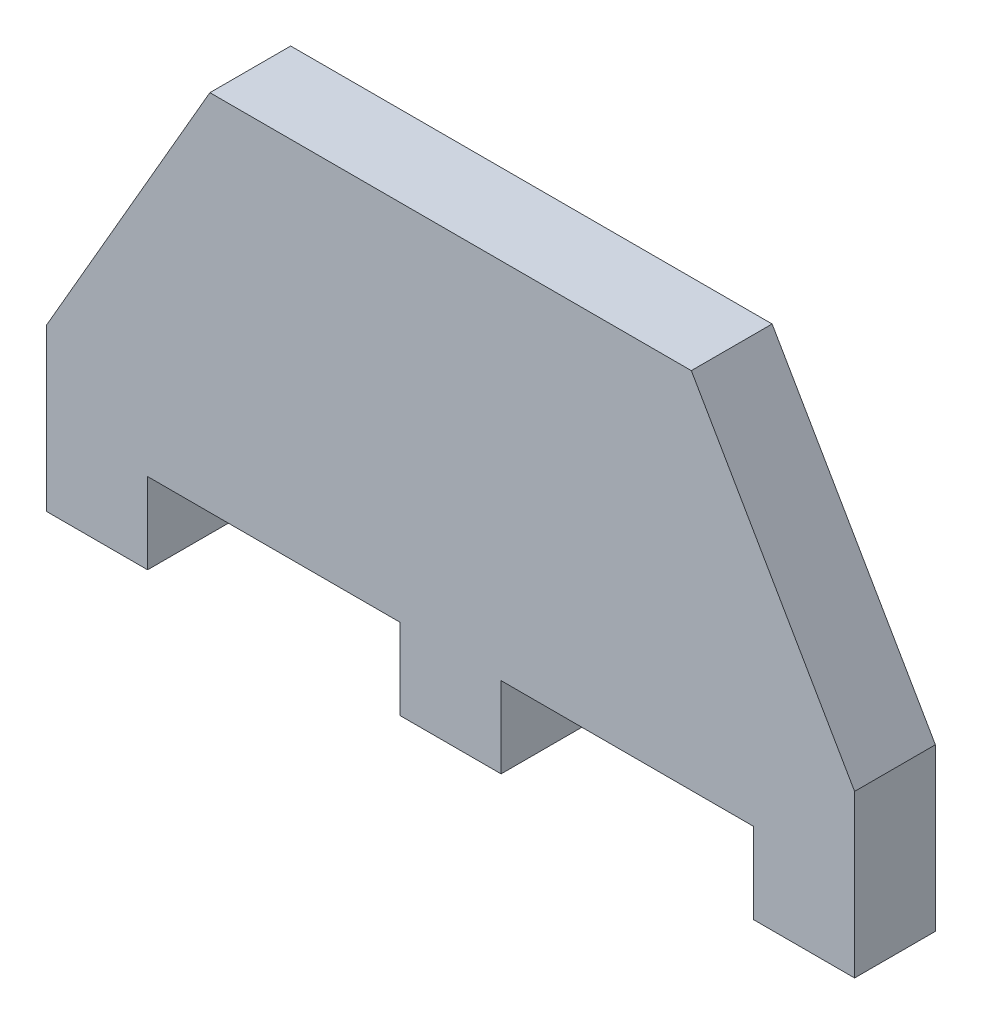
ISO-10303-21;
HEADER;
FILE_DESCRIPTION(('STEP AP214'),'2;1');
FILE_NAME('part.step','',(''),(''),'','','');
FILE_SCHEMA(('AUTOMOTIVE_DESIGN { 1 0 10303 214 1 1 1 1 }'));
ENDSEC;
DATA;
#1=APPLICATION_CONTEXT('core data for automotive mechanical design processes');
#2=APPLICATION_PROTOCOL_DEFINITION('international standard','automotive_design',2000,#1);
#3=PRODUCT_CONTEXT('',#1,'mechanical');
#4=PRODUCT('Part','Part','',(#3));
#5=PRODUCT_RELATED_PRODUCT_CATEGORY('part','',(#4));
#6=PRODUCT_DEFINITION_FORMATION('','',#4);
#7=PRODUCT_DEFINITION_CONTEXT('part definition',#1,'design');
#8=PRODUCT_DEFINITION('design','',#6,#7);
#9=PRODUCT_DEFINITION_SHAPE('','',#8);
#10=(LENGTH_UNIT() NAMED_UNIT(*) SI_UNIT(.MILLI.,.METRE.));
#11=(NAMED_UNIT(*) PLANE_ANGLE_UNIT() SI_UNIT($,.RADIAN.));
#12=(NAMED_UNIT(*) SI_UNIT($,.STERADIAN.) SOLID_ANGLE_UNIT());
#13=UNCERTAINTY_MEASURE_WITH_UNIT(LENGTH_MEASURE(1.E-05),#10,'distance_accuracy_value','');
#14=(GEOMETRIC_REPRESENTATION_CONTEXT(3) GLOBAL_UNCERTAINTY_ASSIGNED_CONTEXT((#13)) GLOBAL_UNIT_ASSIGNED_CONTEXT((#10,
#11,#12)) REPRESENTATION_CONTEXT('',''));
#15=CARTESIAN_POINT('',(0.,0.,0.));
#16=DIRECTION('',(0.,0.,1.));
#17=DIRECTION('',(1.,0.,0.));
#18=AXIS2_PLACEMENT_3D('',#15,#16,#17);
#19=CARTESIAN_POINT('',(0.,0.,10.));
#20=DIRECTION('',(1.,0.,0.));
#21=DIRECTION('',(0.,1.,0.));
#22=AXIS2_PLACEMENT_3D('',#19,#20,#21);
#23=PLANE('',#22);
#24=DIRECTION('',(0.,-1.,0.));
#25=VECTOR('',#24,1.);
#26=CARTESIAN_POINT('',(0.,0.,0.));
#27=LINE('',#26,#25);
#28=CARTESIAN_POINT('',(0.,10.,0.));
#29=VERTEX_POINT('',#28);
#30=CARTESIAN_POINT('',(0.,-10.,0.));
#31=VERTEX_POINT('',#30);
#32=EDGE_CURVE('E102',#29,#31,#27,.T.);
#33=ORIENTED_EDGE('',*,*,#32,.T.);
#34=DIRECTION('',(0.,0.,-1.));
#35=VECTOR('',#34,1.);
#36=CARTESIAN_POINT('',(0.,-10.,10.));
#37=LINE('',#36,#35);
#38=CARTESIAN_POINT('',(0.,-10.,10.));
#39=VERTEX_POINT('',#38);
#40=EDGE_CURVE('E11',#39,#31,#37,.T.);
#41=ORIENTED_EDGE('',*,*,#40,.F.);
#42=DIRECTION('',(0.,-1.,0.));
#43=VECTOR('',#42,1.);
#44=CARTESIAN_POINT('',(0.,10.,10.));
#45=LINE('',#44,#43);
#46=CARTESIAN_POINT('',(0.,10.,10.));
#47=VERTEX_POINT('',#46);
#48=EDGE_CURVE('E108',#47,#39,#45,.T.);
#49=ORIENTED_EDGE('',*,*,#48,.F.);
#50=DIRECTION('',(0.,0.,-1.));
#51=VECTOR('',#50,1.);
#52=CARTESIAN_POINT('',(0.,10.,10.));
#53=LINE('',#52,#51);
#54=EDGE_CURVE('E160',#47,#29,#53,.T.);
#55=ORIENTED_EDGE('',*,*,#54,.T.);
#56=EDGE_LOOP('',(#33,#41,#49,#55));
#57=FACE_BOUND('',#56,.T.);
#58=ADVANCED_FACE('F32',(#57),#23,.F.);
#59=CARTESIAN_POINT('',(0.,-10.,10.));
#60=DIRECTION('',(0.,1.,0.));
#61=DIRECTION('',(0.,0.,1.));
#62=AXIS2_PLACEMENT_3D('',#59,#60,#61);
#63=PLANE('',#62);
#64=DIRECTION('',(1.,0.,0.));
#65=VECTOR('',#64,1.);
#66=CARTESIAN_POINT('',(0.,-10.,0.));
#67=LINE('',#66,#65);
#68=CARTESIAN_POINT('',(12.5,-10.,0.));
#69=VERTEX_POINT('',#68);
#70=EDGE_CURVE('E165',#31,#69,#67,.T.);
#71=ORIENTED_EDGE('',*,*,#70,.T.);
#72=DIRECTION('',(0.,0.,-1.));
#73=VECTOR('',#72,1.);
#74=CARTESIAN_POINT('',(12.5,-10.,10.));
#75=LINE('',#74,#73);
#76=CARTESIAN_POINT('',(12.5,-10.,10.));
#77=VERTEX_POINT('',#76);
#78=EDGE_CURVE('E40',#77,#69,#75,.T.);
#79=ORIENTED_EDGE('',*,*,#78,.F.);
#80=DIRECTION('',(1.,0.,0.));
#81=VECTOR('',#80,1.);
#82=CARTESIAN_POINT('',(0.,-10.,10.));
#83=LINE('',#82,#81);
#84=EDGE_CURVE('E267',#39,#77,#83,.T.);
#85=ORIENTED_EDGE('',*,*,#84,.F.);
#86=ORIENTED_EDGE('',*,*,#40,.T.);
#87=EDGE_LOOP('',(#71,#79,#85,#86));
#88=FACE_BOUND('',#87,.T.);
#89=ADVANCED_FACE('F270',(#88),#63,.F.);
#90=CARTESIAN_POINT('',(12.5,-10.,10.));
#91=DIRECTION('',(-1.,0.,0.));
#92=DIRECTION('',(0.,0.,1.));
#93=AXIS2_PLACEMENT_3D('',#90,#91,#92);
#94=PLANE('',#93);
#95=DIRECTION('',(0.,1.,0.));
#96=VECTOR('',#95,1.);
#97=CARTESIAN_POINT('',(12.5,-10.,0.));
#98=LINE('',#97,#96);
#99=CARTESIAN_POINT('',(12.5,0.,0.));
#100=VERTEX_POINT('',#99);
#101=EDGE_CURVE('E167',#69,#100,#98,.T.);
#102=ORIENTED_EDGE('',*,*,#101,.T.);
#103=DIRECTION('',(0.,0.,-1.));
#104=VECTOR('',#103,1.);
#105=CARTESIAN_POINT('',(12.5,0.,10.));
#106=LINE('',#105,#104);
#107=CARTESIAN_POINT('',(12.5,0.,10.));
#108=VERTEX_POINT('',#107);
#109=EDGE_CURVE('E215',#108,#100,#106,.T.);
#110=ORIENTED_EDGE('',*,*,#109,.F.);
#111=DIRECTION('',(0.,1.,0.));
#112=VECTOR('',#111,1.);
#113=CARTESIAN_POINT('',(12.5,-10.,10.));
#114=LINE('',#113,#112);
#115=EDGE_CURVE('E224',#77,#108,#114,.T.);
#116=ORIENTED_EDGE('',*,*,#115,.F.);
#117=ORIENTED_EDGE('',*,*,#78,.T.);
#118=EDGE_LOOP('',(#102,#110,#116,#117));
#119=FACE_BOUND('',#118,.T.);
#120=ADVANCED_FACE('F222',(#119),#94,.F.);
#121=CARTESIAN_POINT('',(12.5,0.,10.));
#122=DIRECTION('',(0.,1.,0.));
#123=DIRECTION('',(0.,0.,1.));
#124=AXIS2_PLACEMENT_3D('',#121,#122,#123);
#125=PLANE('',#124);
#126=DIRECTION('',(1.,0.,0.));
#127=VECTOR('',#126,1.);
#128=CARTESIAN_POINT('',(12.5,0.,0.));
#129=LINE('',#128,#127);
#130=CARTESIAN_POINT('',(43.75,0.,0.));
#131=VERTEX_POINT('',#130);
#132=EDGE_CURVE('E169',#100,#131,#129,.T.);
#133=ORIENTED_EDGE('',*,*,#132,.T.);
#134=DIRECTION('',(0.,0.,-1.));
#135=VECTOR('',#134,1.);
#136=CARTESIAN_POINT('',(43.75,0.,10.));
#137=LINE('',#136,#135);
#138=CARTESIAN_POINT('',(43.75,0.,10.));
#139=VERTEX_POINT('',#138);
#140=EDGE_CURVE('E212',#139,#131,#137,.T.);
#141=ORIENTED_EDGE('',*,*,#140,.F.);
#142=DIRECTION('',(1.,0.,0.));
#143=VECTOR('',#142,1.);
#144=CARTESIAN_POINT('',(12.5,0.,10.));
#145=LINE('',#144,#143);
#146=EDGE_CURVE('E242',#108,#139,#145,.T.);
#147=ORIENTED_EDGE('',*,*,#146,.F.);
#148=ORIENTED_EDGE('',*,*,#109,.T.);
#149=EDGE_LOOP('',(#133,#141,#147,#148));
#150=FACE_BOUND('',#149,.T.);
#151=ADVANCED_FACE('F233',(#150),#125,.F.);
#152=CARTESIAN_POINT('',(43.75,0.,10.));
#153=DIRECTION('',(1.,0.,0.));
#154=DIRECTION('',(0.,0.,-1.));
#155=AXIS2_PLACEMENT_3D('',#152,#153,#154);
#156=PLANE('',#155);
#157=DIRECTION('',(0.,-1.,0.));
#158=VECTOR('',#157,1.);
#159=CARTESIAN_POINT('',(43.75,0.,0.));
#160=LINE('',#159,#158);
#161=CARTESIAN_POINT('',(43.75,-10.,0.));
#162=VERTEX_POINT('',#161);
#163=EDGE_CURVE('E171',#131,#162,#160,.T.);
#164=ORIENTED_EDGE('',*,*,#163,.T.);
#165=DIRECTION('',(0.,0.,-1.));
#166=VECTOR('',#165,1.);
#167=CARTESIAN_POINT('',(43.75,-10.,10.));
#168=LINE('',#167,#166);
#169=CARTESIAN_POINT('',(43.75,-10.,10.));
#170=VERTEX_POINT('',#169);
#171=EDGE_CURVE('E209',#170,#162,#168,.T.);
#172=ORIENTED_EDGE('',*,*,#171,.F.);
#173=DIRECTION('',(0.,-1.,0.));
#174=VECTOR('',#173,1.);
#175=CARTESIAN_POINT('',(43.75,0.,10.));
#176=LINE('',#175,#174);
#177=EDGE_CURVE('E239',#139,#170,#176,.T.);
#178=ORIENTED_EDGE('',*,*,#177,.F.);
#179=ORIENTED_EDGE('',*,*,#140,.T.);
#180=EDGE_LOOP('',(#164,#172,#178,#179));
#181=FACE_BOUND('',#180,.T.);
#182=ADVANCED_FACE('F237',(#181),#156,.F.);
#183=CARTESIAN_POINT('',(43.75,-10.,10.));
#184=DIRECTION('',(0.,1.,0.));
#185=DIRECTION('',(0.,0.,1.));
#186=AXIS2_PLACEMENT_3D('',#183,#184,#185);
#187=PLANE('',#186);
#188=DIRECTION('',(1.,0.,0.));
#189=VECTOR('',#188,1.);
#190=CARTESIAN_POINT('',(43.75,-10.,0.));
#191=LINE('',#190,#189);
#192=CARTESIAN_POINT('',(56.25,-10.,0.));
#193=VERTEX_POINT('',#192);
#194=EDGE_CURVE('E173',#162,#193,#191,.T.);
#195=ORIENTED_EDGE('',*,*,#194,.T.);
#196=DIRECTION('',(0.,0.,-1.));
#197=VECTOR('',#196,1.);
#198=CARTESIAN_POINT('',(56.25,-10.,10.));
#199=LINE('',#198,#197);
#200=CARTESIAN_POINT('',(56.25,-10.,10.));
#201=VERTEX_POINT('',#200);
#202=EDGE_CURVE('E206',#201,#193,#199,.T.);
#203=ORIENTED_EDGE('',*,*,#202,.F.);
#204=DIRECTION('',(1.,0.,0.));
#205=VECTOR('',#204,1.);
#206=CARTESIAN_POINT('',(43.75,-10.,10.));
#207=LINE('',#206,#205);
#208=EDGE_CURVE('E241',#170,#201,#207,.T.);
#209=ORIENTED_EDGE('',*,*,#208,.F.);
#210=ORIENTED_EDGE('',*,*,#171,.T.);
#211=EDGE_LOOP('',(#195,#203,#209,#210));
#212=FACE_BOUND('',#211,.T.);
#213=ADVANCED_FACE('F282',(#212),#187,.F.);
#214=CARTESIAN_POINT('',(56.25,-10.,10.));
#215=DIRECTION('',(-1.,0.,0.));
#216=DIRECTION('',(0.,0.,1.));
#217=AXIS2_PLACEMENT_3D('',#214,#215,#216);
#218=PLANE('',#217);
#219=DIRECTION('',(0.,1.,0.));
#220=VECTOR('',#219,1.);
#221=CARTESIAN_POINT('',(56.25,-10.,0.));
#222=LINE('',#221,#220);
#223=CARTESIAN_POINT('',(56.25,0.,0.));
#224=VERTEX_POINT('',#223);
#225=EDGE_CURVE('E175',#193,#224,#222,.T.);
#226=ORIENTED_EDGE('',*,*,#225,.T.);
#227=DIRECTION('',(0.,0.,-1.));
#228=VECTOR('',#227,1.);
#229=CARTESIAN_POINT('',(56.25,0.,10.));
#230=LINE('',#229,#228);
#231=CARTESIAN_POINT('',(56.25,0.,10.));
#232=VERTEX_POINT('',#231);
#233=EDGE_CURVE('E203',#232,#224,#230,.T.);
#234=ORIENTED_EDGE('',*,*,#233,.F.);
#235=DIRECTION('',(0.,1.,0.));
#236=VECTOR('',#235,1.);
#237=CARTESIAN_POINT('',(56.25,-10.,10.));
#238=LINE('',#237,#236);
#239=EDGE_CURVE('E244',#201,#232,#238,.T.);
#240=ORIENTED_EDGE('',*,*,#239,.F.);
#241=ORIENTED_EDGE('',*,*,#202,.T.);
#242=EDGE_LOOP('',(#226,#234,#240,#241));
#243=FACE_BOUND('',#242,.T.);
#244=ADVANCED_FACE('F285',(#243),#218,.F.);
#245=CARTESIAN_POINT('',(56.25,0.,10.));
#246=DIRECTION('',(0.,1.,0.));
#247=DIRECTION('',(0.,0.,1.));
#248=AXIS2_PLACEMENT_3D('',#245,#246,#247);
#249=PLANE('',#248);
#250=DIRECTION('',(1.,0.,0.));
#251=VECTOR('',#250,1.);
#252=CARTESIAN_POINT('',(56.25,0.,0.));
#253=LINE('',#252,#251);
#254=CARTESIAN_POINT('',(87.5,0.,0.));
#255=VERTEX_POINT('',#254);
#256=EDGE_CURVE('E177',#224,#255,#253,.T.);
#257=ORIENTED_EDGE('',*,*,#256,.T.);
#258=DIRECTION('',(0.,0.,-1.));
#259=VECTOR('',#258,1.);
#260=CARTESIAN_POINT('',(87.5,0.,10.));
#261=LINE('',#260,#259);
#262=CARTESIAN_POINT('',(87.5,0.,10.));
#263=VERTEX_POINT('',#262);
#264=EDGE_CURVE('E200',#263,#255,#261,.T.);
#265=ORIENTED_EDGE('',*,*,#264,.F.);
#266=DIRECTION('',(1.,0.,0.));
#267=VECTOR('',#266,1.);
#268=CARTESIAN_POINT('',(56.25,0.,10.));
#269=LINE('',#268,#267);
#270=EDGE_CURVE('E250',#232,#263,#269,.T.);
#271=ORIENTED_EDGE('',*,*,#270,.F.);
#272=ORIENTED_EDGE('',*,*,#233,.T.);
#273=EDGE_LOOP('',(#257,#265,#271,#272));
#274=FACE_BOUND('',#273,.T.);
#275=ADVANCED_FACE('F289',(#274),#249,.F.);
#276=CARTESIAN_POINT('',(87.5,0.,10.));
#277=DIRECTION('',(1.,0.,0.));
#278=DIRECTION('',(0.,1.,0.));
#279=AXIS2_PLACEMENT_3D('',#276,#277,#278);
#280=PLANE('',#279);
#281=DIRECTION('',(0.,-1.,0.));
#282=VECTOR('',#281,1.);
#283=CARTESIAN_POINT('',(87.5,0.,0.));
#284=LINE('',#283,#282);
#285=CARTESIAN_POINT('',(87.5,-10.,0.));
#286=VERTEX_POINT('',#285);
#287=EDGE_CURVE('E179',#255,#286,#284,.T.);
#288=ORIENTED_EDGE('',*,*,#287,.T.);
#289=DIRECTION('',(0.,0.,-1.));
#290=VECTOR('',#289,1.);
#291=CARTESIAN_POINT('',(87.5,-10.,10.));
#292=LINE('',#291,#290);
#293=CARTESIAN_POINT('',(87.5,-10.,10.));
#294=VERTEX_POINT('',#293);
#295=EDGE_CURVE('E197',#294,#286,#292,.T.);
#296=ORIENTED_EDGE('',*,*,#295,.F.);
#297=DIRECTION('',(0.,-1.,0.));
#298=VECTOR('',#297,1.);
#299=CARTESIAN_POINT('',(87.5,0.,10.));
#300=LINE('',#299,#298);
#301=EDGE_CURVE('E252',#263,#294,#300,.T.);
#302=ORIENTED_EDGE('',*,*,#301,.F.);
#303=ORIENTED_EDGE('',*,*,#264,.T.);
#304=EDGE_LOOP('',(#288,#296,#302,#303));
#305=FACE_BOUND('',#304,.T.);
#306=ADVANCED_FACE('F293',(#305),#280,.F.);
#307=CARTESIAN_POINT('',(87.5,-10.,10.));
#308=DIRECTION('',(0.,1.,0.));
#309=DIRECTION('',(0.,0.,1.));
#310=AXIS2_PLACEMENT_3D('',#307,#308,#309);
#311=PLANE('',#310);
#312=DIRECTION('',(1.,0.,0.));
#313=VECTOR('',#312,1.);
#314=CARTESIAN_POINT('',(87.5,-10.,0.));
#315=LINE('',#314,#313);
#316=CARTESIAN_POINT('',(100.,-10.,0.));
#317=VERTEX_POINT('',#316);
#318=EDGE_CURVE('E181',#286,#317,#315,.T.);
#319=ORIENTED_EDGE('',*,*,#318,.T.);
#320=DIRECTION('',(0.,0.,-1.));
#321=VECTOR('',#320,1.);
#322=CARTESIAN_POINT('',(100.,-10.,10.));
#323=LINE('',#322,#321);
#324=CARTESIAN_POINT('',(100.,-10.,10.));
#325=VERTEX_POINT('',#324);
#326=EDGE_CURVE('E194',#325,#317,#323,.T.);
#327=ORIENTED_EDGE('',*,*,#326,.F.);
#328=DIRECTION('',(1.,0.,0.));
#329=VECTOR('',#328,1.);
#330=CARTESIAN_POINT('',(87.5,-10.,10.));
#331=LINE('',#330,#329);
#332=EDGE_CURVE('E254',#294,#325,#331,.T.);
#333=ORIENTED_EDGE('',*,*,#332,.F.);
#334=ORIENTED_EDGE('',*,*,#295,.T.);
#335=EDGE_LOOP('',(#319,#327,#333,#334));
#336=FACE_BOUND('',#335,.T.);
#337=ADVANCED_FACE('F260',(#336),#311,.F.);
#338=CARTESIAN_POINT('',(100.,0.,10.));
#339=DIRECTION('',(-1.,0.,0.));
#340=DIRECTION('',(0.,0.,1.));
#341=AXIS2_PLACEMENT_3D('',#338,#339,#340);
#342=PLANE('',#341);
#343=DIRECTION('',(0.,1.,0.));
#344=VECTOR('',#343,1.);
#345=CARTESIAN_POINT('',(100.,0.,0.));
#346=LINE('',#345,#344);
#347=CARTESIAN_POINT('',(100.,10.,0.));
#348=VERTEX_POINT('',#347);
#349=EDGE_CURVE('E184',#317,#348,#346,.T.);
#350=ORIENTED_EDGE('',*,*,#349,.T.);
#351=DIRECTION('',(0.,0.,-1.));
#352=VECTOR('',#351,1.);
#353=CARTESIAN_POINT('',(100.,10.,10.));
#354=LINE('',#353,#352);
#355=CARTESIAN_POINT('',(100.,10.,10.));
#356=VERTEX_POINT('',#355);
#357=EDGE_CURVE('E155',#356,#348,#354,.T.);
#358=ORIENTED_EDGE('',*,*,#357,.F.);
#359=DIRECTION('',(0.,1.,0.));
#360=VECTOR('',#359,1.);
#361=CARTESIAN_POINT('',(100.,-10.,10.));
#362=LINE('',#361,#360);
#363=EDGE_CURVE('E146',#325,#356,#362,.T.);
#364=ORIENTED_EDGE('',*,*,#363,.F.);
#365=ORIENTED_EDGE('',*,*,#326,.T.);
#366=EDGE_LOOP('',(#350,#358,#364,#365));
#367=FACE_BOUND('',#366,.T.);
#368=ADVANCED_FACE('F263',(#367),#342,.F.);
#369=CARTESIAN_POINT('',(100.,10.,10.));
#370=DIRECTION('',(-0.866025403784436,-0.500000000000004,0.));
#371=DIRECTION('',(0.500000000000004,-0.866025403784436,0.));
#372=AXIS2_PLACEMENT_3D('',#369,#370,#371);
#373=PLANE('',#372);
#374=DIRECTION('',(-0.500000000000004,0.866025403784436,0.));
#375=VECTOR('',#374,1.);
#376=CARTESIAN_POINT('',(100.,10.,0.));
#377=LINE('',#376,#375);
#378=CARTESIAN_POINT('',(79.7927405783629,45.,0.));
#379=VERTEX_POINT('',#378);
#380=EDGE_CURVE('E154',#348,#379,#377,.T.);
#381=ORIENTED_EDGE('',*,*,#380,.T.);
#382=DIRECTION('',(0.,0.,-1.));
#383=VECTOR('',#382,1.);
#384=CARTESIAN_POINT('',(79.7927405783629,45.,10.));
#385=LINE('',#384,#383);
#386=CARTESIAN_POINT('',(79.7927405783629,45.,10.));
#387=VERTEX_POINT('',#386);
#388=EDGE_CURVE('E151',#387,#379,#385,.T.);
#389=ORIENTED_EDGE('',*,*,#388,.F.);
#390=DIRECTION('',(-0.500000000000004,0.866025403784436,0.));
#391=VECTOR('',#390,1.);
#392=CARTESIAN_POINT('',(100.,10.,10.));
#393=LINE('',#392,#391);
#394=EDGE_CURVE('E140',#356,#387,#393,.T.);
#395=ORIENTED_EDGE('',*,*,#394,.F.);
#396=ORIENTED_EDGE('',*,*,#357,.T.);
#397=EDGE_LOOP('',(#381,#389,#395,#396));
#398=FACE_BOUND('',#397,.T.);
#399=ADVANCED_FACE('F152',(#398),#373,.F.);
#400=CARTESIAN_POINT('',(79.7927405783629,45.,10.));
#401=DIRECTION('',(0.,-1.,0.));
#402=DIRECTION('',(1.,0.,0.));
#403=AXIS2_PLACEMENT_3D('',#400,#401,#402);
#404=PLANE('',#403);
#405=DIRECTION('',(-1.,0.,0.));
#406=VECTOR('',#405,1.);
#407=CARTESIAN_POINT('',(79.7927405783629,45.,0.));
#408=LINE('',#407,#406);
#409=CARTESIAN_POINT('',(20.2072594216371,45.,0.));
#410=VERTEX_POINT('',#409);
#411=EDGE_CURVE('E95',#379,#410,#408,.T.);
#412=ORIENTED_EDGE('',*,*,#411,.T.);
#413=DIRECTION('',(0.,0.,-1.));
#414=VECTOR('',#413,1.);
#415=CARTESIAN_POINT('',(20.2072594216371,45.,10.));
#416=LINE('',#415,#414);
#417=CARTESIAN_POINT('',(20.2072594216371,45.,10.));
#418=VERTEX_POINT('',#417);
#419=EDGE_CURVE('E156',#418,#410,#416,.T.);
#420=ORIENTED_EDGE('',*,*,#419,.F.);
#421=DIRECTION('',(-1.,0.,0.));
#422=VECTOR('',#421,1.);
#423=CARTESIAN_POINT('',(79.7927405783629,45.,10.));
#424=LINE('',#423,#422);
#425=EDGE_CURVE('E144',#387,#418,#424,.T.);
#426=ORIENTED_EDGE('',*,*,#425,.F.);
#427=ORIENTED_EDGE('',*,*,#388,.T.);
#428=EDGE_LOOP('',(#412,#420,#426,#427));
#429=FACE_BOUND('',#428,.T.);
#430=ADVANCED_FACE('F158',(#429),#404,.F.);
#431=CARTESIAN_POINT('',(20.2072594216371,45.,10.));
#432=DIRECTION('',(0.866025403784436,-0.500000000000004,0.));
#433=DIRECTION('',(0.500000000000004,0.866025403784436,0.));
#434=AXIS2_PLACEMENT_3D('',#431,#432,#433);
#435=PLANE('',#434);
#436=DIRECTION('',(-0.500000000000004,-0.866025403784436,0.));
#437=VECTOR('',#436,1.);
#438=CARTESIAN_POINT('',(20.2072594216371,45.,0.));
#439=LINE('',#438,#437);
#440=EDGE_CURVE('E188',#410,#29,#439,.T.);
#441=ORIENTED_EDGE('',*,*,#440,.T.);
#442=ORIENTED_EDGE('',*,*,#54,.F.);
#443=DIRECTION('',(-0.500000000000004,-0.866025403784436,0.));
#444=VECTOR('',#443,1.);
#445=CARTESIAN_POINT('',(20.2072594216371,45.,10.));
#446=LINE('',#445,#444);
#447=EDGE_CURVE('E48',#418,#47,#446,.T.);
#448=ORIENTED_EDGE('',*,*,#447,.F.);
#449=ORIENTED_EDGE('',*,*,#419,.T.);
#450=EDGE_LOOP('',(#441,#442,#448,#449));
#451=FACE_BOUND('',#450,.T.);
#452=ADVANCED_FACE('F265',(#451),#435,.F.);
#453=CARTESIAN_POINT('',(0.,0.,10.));
#454=DIRECTION('',(0.,0.,1.));
#455=DIRECTION('',(1.,0.,0.));
#456=AXIS2_PLACEMENT_3D('',#453,#454,#455);
#457=PLANE('',#456);
#458=ORIENTED_EDGE('',*,*,#48,.T.);
#459=ORIENTED_EDGE('',*,*,#84,.T.);
#460=ORIENTED_EDGE('',*,*,#115,.T.);
#461=ORIENTED_EDGE('',*,*,#146,.T.);
#462=ORIENTED_EDGE('',*,*,#177,.T.);
#463=ORIENTED_EDGE('',*,*,#208,.T.);
#464=ORIENTED_EDGE('',*,*,#239,.T.);
#465=ORIENTED_EDGE('',*,*,#270,.T.);
#466=ORIENTED_EDGE('',*,*,#301,.T.);
#467=ORIENTED_EDGE('',*,*,#332,.T.);
#468=ORIENTED_EDGE('',*,*,#363,.T.);
#469=ORIENTED_EDGE('',*,*,#394,.T.);
#470=ORIENTED_EDGE('',*,*,#425,.T.);
#471=ORIENTED_EDGE('',*,*,#447,.T.);
#472=EDGE_LOOP('',(#458,#459,#460,#461,#462,#463,#464,#465,#466,#467,#468,#469,#470,#471));
#473=FACE_BOUND('',#472,.T.);
#474=ADVANCED_FACE('F142',(#473),#457,.T.);
#475=CARTESIAN_POINT('',(0.,0.,0.));
#476=DIRECTION('',(0.,0.,1.));
#477=DIRECTION('',(1.,0.,0.));
#478=AXIS2_PLACEMENT_3D('',#475,#476,#477);
#479=PLANE('',#478);
#480=ORIENTED_EDGE('',*,*,#32,.F.);
#481=ORIENTED_EDGE('',*,*,#440,.F.);
#482=ORIENTED_EDGE('',*,*,#411,.F.);
#483=ORIENTED_EDGE('',*,*,#380,.F.);
#484=ORIENTED_EDGE('',*,*,#349,.F.);
#485=ORIENTED_EDGE('',*,*,#318,.F.);
#486=ORIENTED_EDGE('',*,*,#287,.F.);
#487=ORIENTED_EDGE('',*,*,#256,.F.);
#488=ORIENTED_EDGE('',*,*,#225,.F.);
#489=ORIENTED_EDGE('',*,*,#194,.F.);
#490=ORIENTED_EDGE('',*,*,#163,.F.);
#491=ORIENTED_EDGE('',*,*,#132,.F.);
#492=ORIENTED_EDGE('',*,*,#101,.F.);
#493=ORIENTED_EDGE('',*,*,#70,.F.);
#494=EDGE_LOOP('',(#480,#481,#482,#483,#484,#485,#486,#487,#488,#489,#490,#491,#492,#493));
#495=FACE_BOUND('',#494,.T.);
#496=ADVANCED_FACE('F228',(#495),#479,.F.);
#497=CLOSED_SHELL('',(#58,#89,#120,#151,#182,#213,#244,#275,#306,#337,#368,#399,#430,#452,#474,#496));
#498=MANIFOLD_SOLID_BREP('B2',#497);
#499=ADVANCED_BREP_SHAPE_REPRESENTATION('',(#18,#498),#14);
#500=SHAPE_DEFINITION_REPRESENTATION(#9,#499);
ENDSEC;
END-ISO-10303-21;
